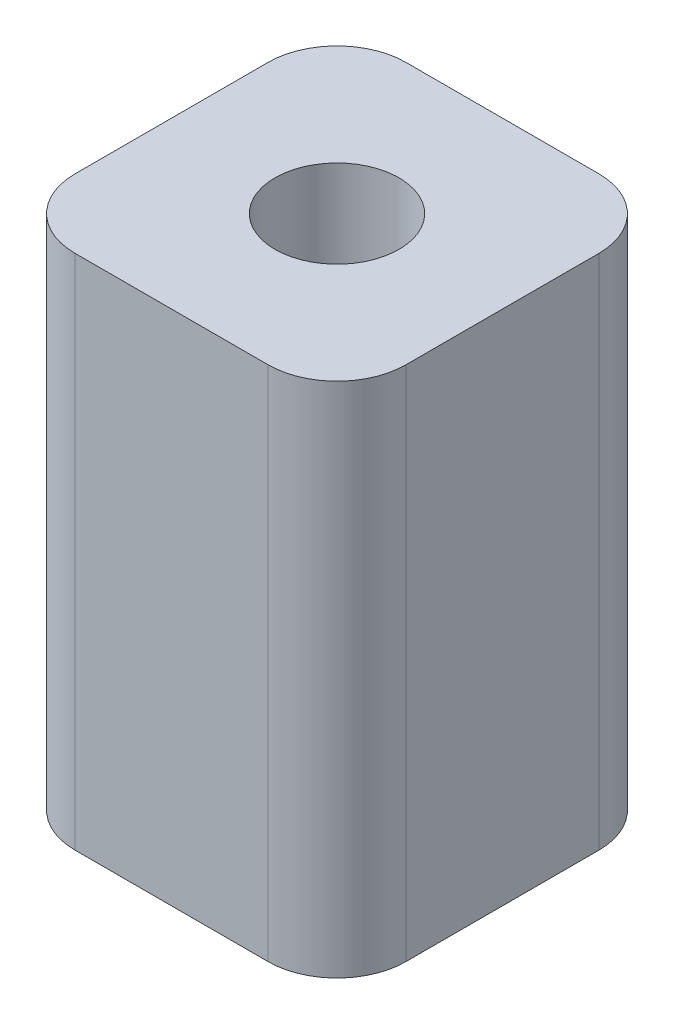
ISO-10303-21;
HEADER;
FILE_DESCRIPTION(('STEP AP214'),'2;1');
FILE_NAME('part.step','',(''),(''),'','','');
FILE_SCHEMA(('AUTOMOTIVE_DESIGN { 1 0 10303 214 1 1 1 1 }'));
ENDSEC;
DATA;
#1=APPLICATION_CONTEXT('core data for automotive mechanical design processes');
#2=APPLICATION_PROTOCOL_DEFINITION('international standard','automotive_design',2000,#1);
#3=PRODUCT_CONTEXT('',#1,'mechanical');
#4=PRODUCT('Part','Part','',(#3));
#5=PRODUCT_RELATED_PRODUCT_CATEGORY('part','',(#4));
#6=PRODUCT_DEFINITION_FORMATION('','',#4);
#7=PRODUCT_DEFINITION_CONTEXT('part definition',#1,'design');
#8=PRODUCT_DEFINITION('design','',#6,#7);
#9=PRODUCT_DEFINITION_SHAPE('','',#8);
#10=(LENGTH_UNIT() NAMED_UNIT(*) SI_UNIT(.MILLI.,.METRE.));
#11=(NAMED_UNIT(*) PLANE_ANGLE_UNIT() SI_UNIT($,.RADIAN.));
#12=(NAMED_UNIT(*) SI_UNIT($,.STERADIAN.) SOLID_ANGLE_UNIT());
#13=UNCERTAINTY_MEASURE_WITH_UNIT(LENGTH_MEASURE(1.E-05),#10,'distance_accuracy_value','');
#14=(GEOMETRIC_REPRESENTATION_CONTEXT(3) GLOBAL_UNCERTAINTY_ASSIGNED_CONTEXT((#13)) GLOBAL_UNIT_ASSIGNED_CONTEXT((#10,
#11,#12)) REPRESENTATION_CONTEXT('',''));
#15=CARTESIAN_POINT('',(0.,0.,0.));
#16=DIRECTION('',(0.,0.,1.));
#17=DIRECTION('',(1.,0.,0.));
#18=AXIS2_PLACEMENT_3D('',#15,#16,#17);
#19=CARTESIAN_POINT('',(0.,7.5,0.));
#20=DIRECTION('',(0.,1.,0.));
#21=DIRECTION('',(0.,0.,1.));
#22=AXIS2_PLACEMENT_3D('',#19,#20,#21);
#23=PLANE('',#22);
#24=DIRECTION('',(0.,0.,-1.));
#25=VECTOR('',#24,1.);
#26=CARTESIAN_POINT('',(4.8,7.5,-4.8));
#27=LINE('',#26,#25);
#28=CARTESIAN_POINT('',(4.8,7.5,2.8));
#29=VERTEX_POINT('',#28);
#30=CARTESIAN_POINT('',(4.8,7.5,-2.8));
#31=VERTEX_POINT('',#30);
#32=EDGE_CURVE('E174',#29,#31,#27,.T.);
#33=ORIENTED_EDGE('',*,*,#32,.T.);
#34=CARTESIAN_POINT('',(2.8,7.5,-2.8));
#35=DIRECTION('',(0.,1.,0.));
#36=DIRECTION('',(0.,0.,1.));
#37=AXIS2_PLACEMENT_3D('',#34,#35,#36);
#38=CIRCLE('',#37,2.);
#39=CARTESIAN_POINT('',(2.8,7.5,-4.8));
#40=VERTEX_POINT('',#39);
#41=EDGE_CURVE('E151',#31,#40,#38,.T.);
#42=ORIENTED_EDGE('',*,*,#41,.T.);
#43=DIRECTION('',(-1.,0.,0.));
#44=VECTOR('',#43,1.);
#45=CARTESIAN_POINT('',(-4.8,7.5,-4.8));
#46=LINE('',#45,#44);
#47=CARTESIAN_POINT('',(-2.8,7.5,-4.8));
#48=VERTEX_POINT('',#47);
#49=EDGE_CURVE('E122',#40,#48,#46,.T.);
#50=ORIENTED_EDGE('',*,*,#49,.T.);
#51=CARTESIAN_POINT('',(-2.8,7.5,-2.8));
#52=DIRECTION('',(0.,1.,0.));
#53=DIRECTION('',(0.,0.,1.));
#54=AXIS2_PLACEMENT_3D('',#51,#52,#53);
#55=CIRCLE('',#54,2.);
#56=CARTESIAN_POINT('',(-4.8,7.5,-2.8));
#57=VERTEX_POINT('',#56);
#58=EDGE_CURVE('E147',#48,#57,#55,.T.);
#59=ORIENTED_EDGE('',*,*,#58,.T.);
#60=DIRECTION('',(0.,0.,1.));
#61=VECTOR('',#60,1.);
#62=CARTESIAN_POINT('',(-4.8,7.5,-4.8));
#63=LINE('',#62,#61);
#64=CARTESIAN_POINT('',(-4.8,7.5,2.8));
#65=VERTEX_POINT('',#64);
#66=EDGE_CURVE('E130',#57,#65,#63,.T.);
#67=ORIENTED_EDGE('',*,*,#66,.T.);
#68=CARTESIAN_POINT('',(-2.8,7.5,2.8));
#69=DIRECTION('',(0.,1.,0.));
#70=DIRECTION('',(0.,0.,1.));
#71=AXIS2_PLACEMENT_3D('',#68,#69,#70);
#72=CIRCLE('',#71,2.);
#73=CARTESIAN_POINT('',(-2.8,7.5,4.8));
#74=VERTEX_POINT('',#73);
#75=EDGE_CURVE('E57',#65,#74,#72,.T.);
#76=ORIENTED_EDGE('',*,*,#75,.T.);
#77=DIRECTION('',(1.,0.,0.));
#78=VECTOR('',#77,1.);
#79=CARTESIAN_POINT('',(-4.8,7.5,4.8));
#80=LINE('',#79,#78);
#81=CARTESIAN_POINT('',(2.8,7.5,4.8));
#82=VERTEX_POINT('',#81);
#83=EDGE_CURVE('E133',#74,#82,#80,.T.);
#84=ORIENTED_EDGE('',*,*,#83,.T.);
#85=CARTESIAN_POINT('',(2.8,7.5,2.8));
#86=DIRECTION('',(0.,1.,0.));
#87=DIRECTION('',(0.,0.,1.));
#88=AXIS2_PLACEMENT_3D('',#85,#86,#87);
#89=CIRCLE('',#88,2.);
#90=EDGE_CURVE('E149',#82,#29,#89,.T.);
#91=ORIENTED_EDGE('',*,*,#90,.T.);
#92=EDGE_LOOP('',(#33,#42,#50,#59,#67,#76,#84,#91));
#93=FACE_BOUND('',#92,.T.);
#94=CARTESIAN_POINT('',(0.,7.5,0.));
#95=DIRECTION('',(0.,1.,0.));
#96=DIRECTION('',(0.,0.,1.));
#97=AXIS2_PLACEMENT_3D('',#94,#95,#96);
#98=CIRCLE('',#97,1.8);
#99=CARTESIAN_POINT('',(0.,7.5,1.8));
#100=VERTEX_POINT('',#99);
#101=EDGE_CURVE('E170',#100,#100,#98,.T.);
#102=ORIENTED_EDGE('',*,*,#101,.F.);
#103=EDGE_LOOP('',(#102));
#104=FACE_BOUND('',#103,.T.);
#105=ADVANCED_FACE('F35',(#93,#104),#23,.T.);
#106=CARTESIAN_POINT('',(0.,-7.5,0.));
#107=DIRECTION('',(0.,1.,0.));
#108=DIRECTION('',(0.,0.,1.));
#109=AXIS2_PLACEMENT_3D('',#106,#107,#108);
#110=PLANE('',#109);
#111=DIRECTION('',(-1.,0.,0.));
#112=VECTOR('',#111,1.);
#113=CARTESIAN_POINT('',(-4.8,-7.5,-4.8));
#114=LINE('',#113,#112);
#115=CARTESIAN_POINT('',(2.8,-7.5,-4.8));
#116=VERTEX_POINT('',#115);
#117=CARTESIAN_POINT('',(-2.8,-7.5,-4.8));
#118=VERTEX_POINT('',#117);
#119=EDGE_CURVE('E119',#116,#118,#114,.T.);
#120=ORIENTED_EDGE('',*,*,#119,.F.);
#121=CARTESIAN_POINT('',(2.8,-7.5,-2.8));
#122=DIRECTION('',(0.,1.,0.));
#123=DIRECTION('',(0.,0.,1.));
#124=AXIS2_PLACEMENT_3D('',#121,#122,#123);
#125=CIRCLE('',#124,2.);
#126=CARTESIAN_POINT('',(4.8,-7.5,-2.8));
#127=VERTEX_POINT('',#126);
#128=EDGE_CURVE('E102',#116,#127,#125,.F.);
#129=ORIENTED_EDGE('',*,*,#128,.T.);
#130=DIRECTION('',(0.,0.,-1.));
#131=VECTOR('',#130,1.);
#132=CARTESIAN_POINT('',(4.8,-7.5,-4.8));
#133=LINE('',#132,#131);
#134=CARTESIAN_POINT('',(4.8,-7.5,2.8));
#135=VERTEX_POINT('',#134);
#136=EDGE_CURVE('E131',#135,#127,#133,.T.);
#137=ORIENTED_EDGE('',*,*,#136,.F.);
#138=CARTESIAN_POINT('',(2.8,-7.5,2.8));
#139=DIRECTION('',(0.,1.,0.));
#140=DIRECTION('',(0.,0.,1.));
#141=AXIS2_PLACEMENT_3D('',#138,#139,#140);
#142=CIRCLE('',#141,2.);
#143=CARTESIAN_POINT('',(2.8,-7.5,4.8));
#144=VERTEX_POINT('',#143);
#145=EDGE_CURVE('E113',#135,#144,#142,.F.);
#146=ORIENTED_EDGE('',*,*,#145,.T.);
#147=DIRECTION('',(1.,0.,0.));
#148=VECTOR('',#147,1.);
#149=CARTESIAN_POINT('',(-4.8,-7.5,4.8));
#150=LINE('',#149,#148);
#151=CARTESIAN_POINT('',(-2.8,-7.5,4.8));
#152=VERTEX_POINT('',#151);
#153=EDGE_CURVE('E135',#152,#144,#150,.T.);
#154=ORIENTED_EDGE('',*,*,#153,.F.);
#155=CARTESIAN_POINT('',(-2.8,-7.5,2.8));
#156=DIRECTION('',(0.,1.,0.));
#157=DIRECTION('',(0.,0.,1.));
#158=AXIS2_PLACEMENT_3D('',#155,#156,#157);
#159=CIRCLE('',#158,2.);
#160=CARTESIAN_POINT('',(-4.8,-7.5,2.8));
#161=VERTEX_POINT('',#160);
#162=EDGE_CURVE('E123',#152,#161,#159,.F.);
#163=ORIENTED_EDGE('',*,*,#162,.T.);
#164=DIRECTION('',(0.,0.,1.));
#165=VECTOR('',#164,1.);
#166=CARTESIAN_POINT('',(-4.8,-7.5,-4.8));
#167=LINE('',#166,#165);
#168=CARTESIAN_POINT('',(-4.8,-7.5,-2.8));
#169=VERTEX_POINT('',#168);
#170=EDGE_CURVE('E162',#169,#161,#167,.T.);
#171=ORIENTED_EDGE('',*,*,#170,.F.);
#172=CARTESIAN_POINT('',(-2.8,-7.5,-2.8));
#173=DIRECTION('',(0.,1.,0.));
#174=DIRECTION('',(0.,0.,1.));
#175=AXIS2_PLACEMENT_3D('',#172,#173,#174);
#176=CIRCLE('',#175,2.);
#177=EDGE_CURVE('E129',#169,#118,#176,.F.);
#178=ORIENTED_EDGE('',*,*,#177,.T.);
#179=EDGE_LOOP('',(#120,#129,#137,#146,#154,#163,#171,#178));
#180=FACE_BOUND('',#179,.T.);
#181=CARTESIAN_POINT('',(0.,-7.5,0.));
#182=DIRECTION('',(0.,1.,0.));
#183=DIRECTION('',(0.,0.,1.));
#184=AXIS2_PLACEMENT_3D('',#181,#182,#183);
#185=CIRCLE('',#184,1.8);
#186=CARTESIAN_POINT('',(0.,-7.5,1.8));
#187=VERTEX_POINT('',#186);
#188=EDGE_CURVE('E177',#187,#187,#185,.T.);
#189=ORIENTED_EDGE('',*,*,#188,.T.);
#190=EDGE_LOOP('',(#189));
#191=FACE_BOUND('',#190,.T.);
#192=ADVANCED_FACE('F126',(#180,#191),#110,.F.);
#193=CARTESIAN_POINT('',(-4.8,7.5,-4.8));
#194=DIRECTION('',(1.,0.,0.));
#195=DIRECTION('',(0.,0.,-1.));
#196=AXIS2_PLACEMENT_3D('',#193,#194,#195);
#197=PLANE('',#196);
#198=ORIENTED_EDGE('',*,*,#66,.F.);
#199=DIRECTION('',(0.,-1.,0.));
#200=VECTOR('',#199,1.);
#201=CARTESIAN_POINT('',(-4.8,7.5,-2.8));
#202=LINE('',#201,#200);
#203=EDGE_CURVE('E11',#57,#169,#202,.T.);
#204=ORIENTED_EDGE('',*,*,#203,.T.);
#205=ORIENTED_EDGE('',*,*,#170,.T.);
#206=DIRECTION('',(0.,-1.,0.));
#207=VECTOR('',#206,1.);
#208=CARTESIAN_POINT('',(-4.8,7.5,2.8));
#209=LINE('',#208,#207);
#210=EDGE_CURVE('E43',#161,#65,#209,.F.);
#211=ORIENTED_EDGE('',*,*,#210,.T.);
#212=EDGE_LOOP('',(#198,#204,#205,#211));
#213=FACE_BOUND('',#212,.T.);
#214=ADVANCED_FACE('F160',(#213),#197,.F.);
#215=CARTESIAN_POINT('',(-4.8,7.5,4.8));
#216=DIRECTION('',(0.,0.,-1.));
#217=DIRECTION('',(-1.,0.,0.));
#218=AXIS2_PLACEMENT_3D('',#215,#216,#217);
#219=PLANE('',#218);
#220=ORIENTED_EDGE('',*,*,#153,.T.);
#221=DIRECTION('',(0.,-1.,0.));
#222=VECTOR('',#221,1.);
#223=CARTESIAN_POINT('',(2.8,7.5,4.8));
#224=LINE('',#223,#222);
#225=EDGE_CURVE('E50',#144,#82,#224,.F.);
#226=ORIENTED_EDGE('',*,*,#225,.T.);
#227=ORIENTED_EDGE('',*,*,#83,.F.);
#228=DIRECTION('',(0.,-1.,0.));
#229=VECTOR('',#228,1.);
#230=CARTESIAN_POINT('',(-2.8,7.5,4.8));
#231=LINE('',#230,#229);
#232=EDGE_CURVE('E153',#74,#152,#231,.T.);
#233=ORIENTED_EDGE('',*,*,#232,.T.);
#234=EDGE_LOOP('',(#220,#226,#227,#233));
#235=FACE_BOUND('',#234,.T.);
#236=ADVANCED_FACE('F169',(#235),#219,.F.);
#237=CARTESIAN_POINT('',(4.8,7.5,-4.8));
#238=DIRECTION('',(-1.,0.,0.));
#239=DIRECTION('',(0.,0.,1.));
#240=AXIS2_PLACEMENT_3D('',#237,#238,#239);
#241=PLANE('',#240);
#242=ORIENTED_EDGE('',*,*,#136,.T.);
#243=DIRECTION('',(0.,-1.,0.));
#244=VECTOR('',#243,1.);
#245=CARTESIAN_POINT('',(4.8,7.5,-2.8));
#246=LINE('',#245,#244);
#247=EDGE_CURVE('E107',#127,#31,#246,.F.);
#248=ORIENTED_EDGE('',*,*,#247,.T.);
#249=ORIENTED_EDGE('',*,*,#32,.F.);
#250=DIRECTION('',(0.,-1.,0.));
#251=VECTOR('',#250,1.);
#252=CARTESIAN_POINT('',(4.8,7.5,2.8));
#253=LINE('',#252,#251);
#254=EDGE_CURVE('E112',#29,#135,#253,.T.);
#255=ORIENTED_EDGE('',*,*,#254,.T.);
#256=EDGE_LOOP('',(#242,#248,#249,#255));
#257=FACE_BOUND('',#256,.T.);
#258=ADVANCED_FACE('F195',(#257),#241,.F.);
#259=CARTESIAN_POINT('',(-4.8,7.5,-4.8));
#260=DIRECTION('',(0.,0.,1.));
#261=DIRECTION('',(1.,0.,0.));
#262=AXIS2_PLACEMENT_3D('',#259,#260,#261);
#263=PLANE('',#262);
#264=ORIENTED_EDGE('',*,*,#49,.F.);
#265=DIRECTION('',(0.,-1.,0.));
#266=VECTOR('',#265,1.);
#267=CARTESIAN_POINT('',(2.8,7.5,-4.8));
#268=LINE('',#267,#266);
#269=EDGE_CURVE('E106',#40,#116,#268,.T.);
#270=ORIENTED_EDGE('',*,*,#269,.T.);
#271=ORIENTED_EDGE('',*,*,#119,.T.);
#272=DIRECTION('',(0.,-1.,0.));
#273=VECTOR('',#272,1.);
#274=CARTESIAN_POINT('',(-2.8,7.5,-4.8));
#275=LINE('',#274,#273);
#276=EDGE_CURVE('E124',#118,#48,#275,.F.);
#277=ORIENTED_EDGE('',*,*,#276,.T.);
#278=EDGE_LOOP('',(#264,#270,#271,#277));
#279=FACE_BOUND('',#278,.T.);
#280=ADVANCED_FACE('F118',(#279),#263,.F.);
#281=CARTESIAN_POINT('',(0.,7.5,0.));
#282=DIRECTION('',(0.,-1.,0.));
#283=DIRECTION('',(0.,0.,-1.));
#284=AXIS2_PLACEMENT_3D('',#281,#282,#283);
#285=CYLINDRICAL_SURFACE('',#284,1.8);
#286=ORIENTED_EDGE('',*,*,#101,.T.);
#287=EDGE_LOOP('',(#286));
#288=FACE_BOUND('',#287,.T.);
#289=ORIENTED_EDGE('',*,*,#188,.F.);
#290=EDGE_LOOP('',(#289));
#291=FACE_BOUND('',#290,.T.);
#292=ADVANCED_FACE('F183',(#288,#291),#285,.F.);
#293=CARTESIAN_POINT('',(2.8,7.5,-2.8));
#294=DIRECTION('',(0.,-1.,0.));
#295=DIRECTION('',(0.,0.,-1.));
#296=AXIS2_PLACEMENT_3D('',#293,#294,#295);
#297=CYLINDRICAL_SURFACE('',#296,2.);
#298=ORIENTED_EDGE('',*,*,#41,.F.);
#299=ORIENTED_EDGE('',*,*,#247,.F.);
#300=ORIENTED_EDGE('',*,*,#128,.F.);
#301=ORIENTED_EDGE('',*,*,#269,.F.);
#302=EDGE_LOOP('',(#298,#299,#300,#301));
#303=FACE_BOUND('',#302,.T.);
#304=ADVANCED_FACE('F105',(#303),#297,.T.);
#305=CARTESIAN_POINT('',(2.8,7.5,2.8));
#306=DIRECTION('',(0.,-1.,0.));
#307=DIRECTION('',(0.,0.,-1.));
#308=AXIS2_PLACEMENT_3D('',#305,#306,#307);
#309=CYLINDRICAL_SURFACE('',#308,2.);
#310=ORIENTED_EDGE('',*,*,#90,.F.);
#311=ORIENTED_EDGE('',*,*,#225,.F.);
#312=ORIENTED_EDGE('',*,*,#145,.F.);
#313=ORIENTED_EDGE('',*,*,#254,.F.);
#314=EDGE_LOOP('',(#310,#311,#312,#313));
#315=FACE_BOUND('',#314,.T.);
#316=ADVANCED_FACE('F205',(#315),#309,.T.);
#317=CARTESIAN_POINT('',(-2.8,7.5,-2.8));
#318=DIRECTION('',(0.,-1.,0.));
#319=DIRECTION('',(0.,0.,-1.));
#320=AXIS2_PLACEMENT_3D('',#317,#318,#319);
#321=CYLINDRICAL_SURFACE('',#320,2.);
#322=ORIENTED_EDGE('',*,*,#58,.F.);
#323=ORIENTED_EDGE('',*,*,#276,.F.);
#324=ORIENTED_EDGE('',*,*,#177,.F.);
#325=ORIENTED_EDGE('',*,*,#203,.F.);
#326=EDGE_LOOP('',(#322,#323,#324,#325));
#327=FACE_BOUND('',#326,.T.);
#328=ADVANCED_FACE('F207',(#327),#321,.T.);
#329=CARTESIAN_POINT('',(-2.8,7.5,2.8));
#330=DIRECTION('',(0.,-1.,0.));
#331=DIRECTION('',(0.,0.,-1.));
#332=AXIS2_PLACEMENT_3D('',#329,#330,#331);
#333=CYLINDRICAL_SURFACE('',#332,2.);
#334=ORIENTED_EDGE('',*,*,#75,.F.);
#335=ORIENTED_EDGE('',*,*,#210,.F.);
#336=ORIENTED_EDGE('',*,*,#162,.F.);
#337=ORIENTED_EDGE('',*,*,#232,.F.);
#338=EDGE_LOOP('',(#334,#335,#336,#337));
#339=FACE_BOUND('',#338,.T.);
#340=ADVANCED_FACE('F37',(#339),#333,.T.);
#341=CLOSED_SHELL('',(#105,#192,#214,#236,#258,#280,#292,#304,#316,#328,#340));
#342=MANIFOLD_SOLID_BREP('B2',#341);
#343=ADVANCED_BREP_SHAPE_REPRESENTATION('',(#18,#342),#14);
#344=SHAPE_DEFINITION_REPRESENTATION(#9,#343);
ENDSEC;
END-ISO-10303-21;
